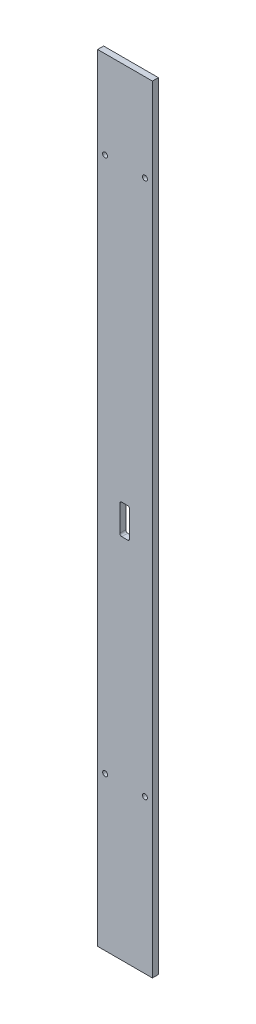
ISO-10303-21;
HEADER;
FILE_DESCRIPTION(('STEP AP214'),'2;1');
FILE_NAME('part.step','',(''),(''),'','','');
FILE_SCHEMA(('AUTOMOTIVE_DESIGN { 1 0 10303 214 1 1 1 1 }'));
ENDSEC;
DATA;
#1=APPLICATION_CONTEXT('core data for automotive mechanical design processes');
#2=APPLICATION_PROTOCOL_DEFINITION('international standard','automotive_design',2000,#1);
#3=PRODUCT_CONTEXT('',#1,'mechanical');
#4=PRODUCT('Part','Part','',(#3));
#5=PRODUCT_RELATED_PRODUCT_CATEGORY('part','',(#4));
#6=PRODUCT_DEFINITION_FORMATION('','',#4);
#7=PRODUCT_DEFINITION_CONTEXT('part definition',#1,'design');
#8=PRODUCT_DEFINITION('design','',#6,#7);
#9=PRODUCT_DEFINITION_SHAPE('','',#8);
#10=(LENGTH_UNIT() NAMED_UNIT(*) SI_UNIT(.MILLI.,.METRE.));
#11=(NAMED_UNIT(*) PLANE_ANGLE_UNIT() SI_UNIT($,.RADIAN.));
#12=(NAMED_UNIT(*) SI_UNIT($,.STERADIAN.) SOLID_ANGLE_UNIT());
#13=UNCERTAINTY_MEASURE_WITH_UNIT(LENGTH_MEASURE(1.E-05),#10,'distance_accuracy_value','');
#14=(GEOMETRIC_REPRESENTATION_CONTEXT(3) GLOBAL_UNCERTAINTY_ASSIGNED_CONTEXT((#13)) GLOBAL_UNIT_ASSIGNED_CONTEXT((#10,
#11,#12)) REPRESENTATION_CONTEXT('',''));
#15=CARTESIAN_POINT('',(0.,0.,0.));
#16=DIRECTION('',(0.,0.,1.));
#17=DIRECTION('',(1.,0.,0.));
#18=AXIS2_PLACEMENT_3D('',#15,#16,#17);
#19=CARTESIAN_POINT('',(-27.5,-390.,3.));
#20=DIRECTION('',(1.,0.,0.));
#21=DIRECTION('',(0.,0.,-1.));
#22=AXIS2_PLACEMENT_3D('',#19,#20,#21);
#23=PLANE('',#22);
#24=DIRECTION('',(0.,-1.,0.));
#25=VECTOR('',#24,1.);
#26=CARTESIAN_POINT('',(-27.5,-390.,-3.));
#27=LINE('',#26,#25);
#28=CARTESIAN_POINT('',(-27.5,390.,-3.));
#29=VERTEX_POINT('',#28);
#30=CARTESIAN_POINT('',(-27.5,-390.,-3.));
#31=VERTEX_POINT('',#30);
#32=EDGE_CURVE('E185',#29,#31,#27,.T.);
#33=ORIENTED_EDGE('',*,*,#32,.T.);
#34=DIRECTION('',(0.,0.,-1.));
#35=VECTOR('',#34,1.);
#36=CARTESIAN_POINT('',(-27.5,-390.,3.));
#37=LINE('',#36,#35);
#38=CARTESIAN_POINT('',(-27.5,-390.,3.));
#39=VERTEX_POINT('',#38);
#40=EDGE_CURVE('E11',#39,#31,#37,.T.);
#41=ORIENTED_EDGE('',*,*,#40,.F.);
#42=DIRECTION('',(0.,-1.,0.));
#43=VECTOR('',#42,1.);
#44=CARTESIAN_POINT('',(-27.5,-390.,3.));
#45=LINE('',#44,#43);
#46=CARTESIAN_POINT('',(-27.5,390.,3.));
#47=VERTEX_POINT('',#46);
#48=EDGE_CURVE('E197',#47,#39,#45,.T.);
#49=ORIENTED_EDGE('',*,*,#48,.F.);
#50=DIRECTION('',(0.,0.,-1.));
#51=VECTOR('',#50,1.);
#52=CARTESIAN_POINT('',(-27.5,390.,3.));
#53=LINE('',#52,#51);
#54=EDGE_CURVE('E207',#47,#29,#53,.T.);
#55=ORIENTED_EDGE('',*,*,#54,.T.);
#56=EDGE_LOOP('',(#33,#41,#49,#55));
#57=FACE_BOUND('',#56,.T.);
#58=ADVANCED_FACE('F36',(#57),#23,.F.);
#59=CARTESIAN_POINT('',(27.5,-390.,3.));
#60=DIRECTION('',(0.,1.,0.));
#61=DIRECTION('',(0.,0.,1.));
#62=AXIS2_PLACEMENT_3D('',#59,#60,#61);
#63=PLANE('',#62);
#64=DIRECTION('',(1.,0.,0.));
#65=VECTOR('',#64,1.);
#66=CARTESIAN_POINT('',(27.5,-390.,-3.));
#67=LINE('',#66,#65);
#68=CARTESIAN_POINT('',(27.5,-390.,-3.));
#69=VERTEX_POINT('',#68);
#70=EDGE_CURVE('E210',#31,#69,#67,.T.);
#71=ORIENTED_EDGE('',*,*,#70,.T.);
#72=DIRECTION('',(0.,0.,-1.));
#73=VECTOR('',#72,1.);
#74=CARTESIAN_POINT('',(27.5,-390.,3.));
#75=LINE('',#74,#73);
#76=CARTESIAN_POINT('',(27.5,-390.,3.));
#77=VERTEX_POINT('',#76);
#78=EDGE_CURVE('E44',#77,#69,#75,.T.);
#79=ORIENTED_EDGE('',*,*,#78,.F.);
#80=DIRECTION('',(1.,0.,0.));
#81=VECTOR('',#80,1.);
#82=CARTESIAN_POINT('',(27.5,-390.,3.));
#83=LINE('',#82,#81);
#84=EDGE_CURVE('E200',#39,#77,#83,.T.);
#85=ORIENTED_EDGE('',*,*,#84,.F.);
#86=ORIENTED_EDGE('',*,*,#40,.T.);
#87=EDGE_LOOP('',(#71,#79,#85,#86));
#88=FACE_BOUND('',#87,.T.);
#89=ADVANCED_FACE('F239',(#88),#63,.F.);
#90=CARTESIAN_POINT('',(27.5,-390.,3.));
#91=DIRECTION('',(-1.,0.,0.));
#92=DIRECTION('',(0.,0.,1.));
#93=AXIS2_PLACEMENT_3D('',#90,#91,#92);
#94=PLANE('',#93);
#95=DIRECTION('',(0.,1.,0.));
#96=VECTOR('',#95,1.);
#97=CARTESIAN_POINT('',(27.5,-390.,-3.));
#98=LINE('',#97,#96);
#99=CARTESIAN_POINT('',(27.5,390.,-3.));
#100=VERTEX_POINT('',#99);
#101=EDGE_CURVE('E212',#69,#100,#98,.T.);
#102=ORIENTED_EDGE('',*,*,#101,.T.);
#103=DIRECTION('',(0.,0.,-1.));
#104=VECTOR('',#103,1.);
#105=CARTESIAN_POINT('',(27.5,390.,3.));
#106=LINE('',#105,#104);
#107=CARTESIAN_POINT('',(27.5,390.,3.));
#108=VERTEX_POINT('',#107);
#109=EDGE_CURVE('E217',#108,#100,#106,.T.);
#110=ORIENTED_EDGE('',*,*,#109,.F.);
#111=DIRECTION('',(0.,1.,0.));
#112=VECTOR('',#111,1.);
#113=CARTESIAN_POINT('',(27.5,-390.,3.));
#114=LINE('',#113,#112);
#115=EDGE_CURVE('E203',#77,#108,#114,.T.);
#116=ORIENTED_EDGE('',*,*,#115,.F.);
#117=ORIENTED_EDGE('',*,*,#78,.T.);
#118=EDGE_LOOP('',(#102,#110,#116,#117));
#119=FACE_BOUND('',#118,.T.);
#120=ADVANCED_FACE('F225',(#119),#94,.F.);
#121=CARTESIAN_POINT('',(27.5,390.,3.));
#122=DIRECTION('',(0.,-1.,0.));
#123=DIRECTION('',(0.,0.,-1.));
#124=AXIS2_PLACEMENT_3D('',#121,#122,#123);
#125=PLANE('',#124);
#126=DIRECTION('',(-1.,0.,0.));
#127=VECTOR('',#126,1.);
#128=CARTESIAN_POINT('',(27.5,390.,-3.));
#129=LINE('',#128,#127);
#130=EDGE_CURVE('E201',#100,#29,#129,.T.);
#131=ORIENTED_EDGE('',*,*,#130,.T.);
#132=ORIENTED_EDGE('',*,*,#54,.F.);
#133=DIRECTION('',(-1.,0.,0.));
#134=VECTOR('',#133,1.);
#135=CARTESIAN_POINT('',(27.5,390.,3.));
#136=LINE('',#135,#134);
#137=EDGE_CURVE('E205',#108,#47,#136,.T.);
#138=ORIENTED_EDGE('',*,*,#137,.F.);
#139=ORIENTED_EDGE('',*,*,#109,.T.);
#140=EDGE_LOOP('',(#131,#132,#138,#139));
#141=FACE_BOUND('',#140,.T.);
#142=ADVANCED_FACE('F234',(#141),#125,.F.);
#143=CARTESIAN_POINT('',(0.,0.,3.));
#144=DIRECTION('',(0.,0.,1.));
#145=DIRECTION('',(1.,0.,0.));
#146=AXIS2_PLACEMENT_3D('',#143,#144,#145);
#147=PLANE('',#146);
#148=CARTESIAN_POINT('',(-20.,302.,3.));
#149=DIRECTION('',(0.,0.,1.));
#150=DIRECTION('',(1.,0.,0.));
#151=AXIS2_PLACEMENT_3D('',#148,#149,#150);
#152=CIRCLE('',#151,2.49999999999999);
#153=CARTESIAN_POINT('',(-17.5,302.,3.));
#154=VERTEX_POINT('',#153);
#155=EDGE_CURVE('E302',#154,#154,#152,.T.);
#156=ORIENTED_EDGE('',*,*,#155,.F.);
#157=EDGE_LOOP('',(#156));
#158=FACE_BOUND('',#157,.T.);
#159=CARTESIAN_POINT('',(20.,302.,3.));
#160=DIRECTION('',(0.,0.,1.));
#161=DIRECTION('',(1.,0.,0.));
#162=AXIS2_PLACEMENT_3D('',#159,#160,#161);
#163=CIRCLE('',#162,2.49999999999999);
#164=CARTESIAN_POINT('',(22.5,302.,3.));
#165=VERTEX_POINT('',#164);
#166=EDGE_CURVE('E312',#165,#165,#163,.T.);
#167=ORIENTED_EDGE('',*,*,#166,.F.);
#168=EDGE_LOOP('',(#167));
#169=FACE_BOUND('',#168,.T.);
#170=CARTESIAN_POINT('',(-20.0000000000001,-236.,3.));
#171=DIRECTION('',(0.,0.,1.));
#172=DIRECTION('',(1.,0.,0.));
#173=AXIS2_PLACEMENT_3D('',#170,#171,#172);
#174=CIRCLE('',#173,2.49999999999999);
#175=CARTESIAN_POINT('',(-17.5000000000001,-236.,3.));
#176=VERTEX_POINT('',#175);
#177=EDGE_CURVE('E317',#176,#176,#174,.T.);
#178=ORIENTED_EDGE('',*,*,#177,.F.);
#179=EDGE_LOOP('',(#178));
#180=FACE_BOUND('',#179,.T.);
#181=CARTESIAN_POINT('',(19.9999999999999,-236.,3.));
#182=DIRECTION('',(0.,0.,1.));
#183=DIRECTION('',(1.,0.,0.));
#184=AXIS2_PLACEMENT_3D('',#181,#182,#183);
#185=CIRCLE('',#184,2.49999999999999);
#186=CARTESIAN_POINT('',(22.4999999999999,-236.,3.));
#187=VERTEX_POINT('',#186);
#188=EDGE_CURVE('E39',#187,#187,#185,.T.);
#189=ORIENTED_EDGE('',*,*,#188,.F.);
#190=EDGE_LOOP('',(#189));
#191=FACE_BOUND('',#190,.T.);
#192=CARTESIAN_POINT('',(-3.25198604520332,6.42058506658847,3.));
#193=DIRECTION('',(0.,0.,-1.));
#194=DIRECTION('',(-1.,0.,0.));
#195=AXIS2_PLACEMENT_3D('',#192,#193,#194);
#196=CIRCLE('',#195,2.);
#197=CARTESIAN_POINT('',(-5.25198604520332,6.42058506658847,3.));
#198=VERTEX_POINT('',#197);
#199=CARTESIAN_POINT('',(-3.25198604520332,8.42058506658847,3.));
#200=VERTEX_POINT('',#199);
#201=EDGE_CURVE('E127',#198,#200,#196,.T.);
#202=ORIENTED_EDGE('',*,*,#201,.T.);
#203=DIRECTION('',(1.,0.,0.));
#204=VECTOR('',#203,1.);
#205=CARTESIAN_POINT('',(-3.25198604520332,8.42058506658847,3.));
#206=LINE('',#205,#204);
#207=CARTESIAN_POINT('',(2.74801395479668,8.42058506658847,3.));
#208=VERTEX_POINT('',#207);
#209=EDGE_CURVE('E136',#200,#208,#206,.T.);
#210=ORIENTED_EDGE('',*,*,#209,.T.);
#211=CARTESIAN_POINT('',(2.74801395479668,6.42058506658847,3.));
#212=DIRECTION('',(0.,0.,-1.));
#213=DIRECTION('',(-1.,0.,0.));
#214=AXIS2_PLACEMENT_3D('',#211,#212,#213);
#215=CIRCLE('',#214,2.);
#216=CARTESIAN_POINT('',(4.74801395479668,6.42058506658847,3.));
#217=VERTEX_POINT('',#216);
#218=EDGE_CURVE('E51',#208,#217,#215,.T.);
#219=ORIENTED_EDGE('',*,*,#218,.T.);
#220=DIRECTION('',(0.,-1.,0.));
#221=VECTOR('',#220,1.);
#222=CARTESIAN_POINT('',(4.74801395479668,-19.5794149334115,3.));
#223=LINE('',#222,#221);
#224=CARTESIAN_POINT('',(4.74801395479668,-19.5794149334115,3.));
#225=VERTEX_POINT('',#224);
#226=EDGE_CURVE('E154',#217,#225,#223,.T.);
#227=ORIENTED_EDGE('',*,*,#226,.T.);
#228=CARTESIAN_POINT('',(2.74801395479668,-19.5794149334115,3.));
#229=DIRECTION('',(0.,0.,-1.));
#230=DIRECTION('',(1.,0.,0.));
#231=AXIS2_PLACEMENT_3D('',#228,#229,#230);
#232=CIRCLE('',#231,2.);
#233=CARTESIAN_POINT('',(2.74801395479668,-21.5794149334115,3.));
#234=VERTEX_POINT('',#233);
#235=EDGE_CURVE('E157',#225,#234,#232,.T.);
#236=ORIENTED_EDGE('',*,*,#235,.T.);
#237=DIRECTION('',(-1.,0.,0.));
#238=VECTOR('',#237,1.);
#239=CARTESIAN_POINT('',(-3.25198604520332,-21.5794149334115,3.));
#240=LINE('',#239,#238);
#241=CARTESIAN_POINT('',(-3.25198604520332,-21.5794149334115,3.));
#242=VERTEX_POINT('',#241);
#243=EDGE_CURVE('E160',#234,#242,#240,.T.);
#244=ORIENTED_EDGE('',*,*,#243,.T.);
#245=CARTESIAN_POINT('',(-3.25198604520332,-19.5794149334115,3.));
#246=DIRECTION('',(0.,0.,-1.));
#247=DIRECTION('',(-1.,0.,0.));
#248=AXIS2_PLACEMENT_3D('',#245,#246,#247);
#249=CIRCLE('',#248,2.);
#250=CARTESIAN_POINT('',(-5.25198604520332,-19.5794149334115,3.));
#251=VERTEX_POINT('',#250);
#252=EDGE_CURVE('E163',#242,#251,#249,.T.);
#253=ORIENTED_EDGE('',*,*,#252,.T.);
#254=DIRECTION('',(0.,1.,0.));
#255=VECTOR('',#254,1.);
#256=CARTESIAN_POINT('',(-5.25198604520332,-19.5794149334115,3.));
#257=LINE('',#256,#255);
#258=EDGE_CURVE('E133',#251,#198,#257,.T.);
#259=ORIENTED_EDGE('',*,*,#258,.T.);
#260=EDGE_LOOP('',(#202,#210,#219,#227,#236,#244,#253,#259));
#261=FACE_BOUND('',#260,.T.);
#262=ORIENTED_EDGE('',*,*,#48,.T.);
#263=ORIENTED_EDGE('',*,*,#84,.T.);
#264=ORIENTED_EDGE('',*,*,#115,.T.);
#265=ORIENTED_EDGE('',*,*,#137,.T.);
#266=EDGE_LOOP('',(#262,#263,#264,#265));
#267=FACE_BOUND('',#266,.T.);
#268=ADVANCED_FACE('F140',(#158,#169,#180,#191,#261,#267),#147,.T.);
#269=CARTESIAN_POINT('',(0.,0.,-3.));
#270=DIRECTION('',(0.,0.,1.));
#271=DIRECTION('',(1.,0.,0.));
#272=AXIS2_PLACEMENT_3D('',#269,#270,#271);
#273=PLANE('',#272);
#274=CARTESIAN_POINT('',(-20.,302.,-3.));
#275=DIRECTION('',(0.,0.,-1.));
#276=DIRECTION('',(-1.,0.,0.));
#277=AXIS2_PLACEMENT_3D('',#274,#275,#276);
#278=CIRCLE('',#277,2.49999999999999);
#279=CARTESIAN_POINT('',(-22.5,302.,-3.));
#280=VERTEX_POINT('',#279);
#281=EDGE_CURVE('E305',#280,#280,#278,.T.);
#282=ORIENTED_EDGE('',*,*,#281,.F.);
#283=EDGE_LOOP('',(#282));
#284=FACE_BOUND('',#283,.T.);
#285=CARTESIAN_POINT('',(20.,302.,-3.));
#286=DIRECTION('',(0.,0.,-1.));
#287=DIRECTION('',(-1.,0.,0.));
#288=AXIS2_PLACEMENT_3D('',#285,#286,#287);
#289=CIRCLE('',#288,2.49999999999999);
#290=CARTESIAN_POINT('',(17.5,302.,-3.));
#291=VERTEX_POINT('',#290);
#292=EDGE_CURVE('E307',#291,#291,#289,.T.);
#293=ORIENTED_EDGE('',*,*,#292,.F.);
#294=EDGE_LOOP('',(#293));
#295=FACE_BOUND('',#294,.T.);
#296=CARTESIAN_POINT('',(-20.0000000000001,-236.,-3.));
#297=DIRECTION('',(0.,0.,-1.));
#298=DIRECTION('',(-1.,0.,0.));
#299=AXIS2_PLACEMENT_3D('',#296,#297,#298);
#300=CIRCLE('',#299,2.49999999999999);
#301=CARTESIAN_POINT('',(-22.5000000000001,-236.,-3.));
#302=VERTEX_POINT('',#301);
#303=EDGE_CURVE('E315',#302,#302,#300,.T.);
#304=ORIENTED_EDGE('',*,*,#303,.F.);
#305=EDGE_LOOP('',(#304));
#306=FACE_BOUND('',#305,.T.);
#307=CARTESIAN_POINT('',(19.9999999999999,-236.,-3.));
#308=DIRECTION('',(0.,0.,-1.));
#309=DIRECTION('',(-1.,0.,0.));
#310=AXIS2_PLACEMENT_3D('',#307,#308,#309);
#311=CIRCLE('',#310,2.49999999999999);
#312=CARTESIAN_POINT('',(17.4999999999999,-236.,-3.));
#313=VERTEX_POINT('',#312);
#314=EDGE_CURVE('E150',#313,#313,#311,.T.);
#315=ORIENTED_EDGE('',*,*,#314,.F.);
#316=EDGE_LOOP('',(#315));
#317=FACE_BOUND('',#316,.T.);
#318=DIRECTION('',(1.,0.,0.));
#319=VECTOR('',#318,1.);
#320=CARTESIAN_POINT('',(-3.25198604520332,8.42058506658847,-3.));
#321=LINE('',#320,#319);
#322=CARTESIAN_POINT('',(-3.25198604520332,8.42058506658847,-3.));
#323=VERTEX_POINT('',#322);
#324=CARTESIAN_POINT('',(2.74801395479668,8.42058506658847,-3.));
#325=VERTEX_POINT('',#324);
#326=EDGE_CURVE('E167',#323,#325,#321,.T.);
#327=ORIENTED_EDGE('',*,*,#326,.F.);
#328=CARTESIAN_POINT('',(-3.25198604520332,6.42058506658847,-3.));
#329=DIRECTION('',(0.,0.,-1.));
#330=DIRECTION('',(-1.,0.,0.));
#331=AXIS2_PLACEMENT_3D('',#328,#329,#330);
#332=CIRCLE('',#331,2.);
#333=CARTESIAN_POINT('',(-5.25198604520332,6.42058506658847,-3.));
#334=VERTEX_POINT('',#333);
#335=EDGE_CURVE('E59',#334,#323,#332,.T.);
#336=ORIENTED_EDGE('',*,*,#335,.F.);
#337=DIRECTION('',(0.,1.,0.));
#338=VECTOR('',#337,1.);
#339=CARTESIAN_POINT('',(-5.25198604520332,-19.5794149334115,-3.));
#340=LINE('',#339,#338);
#341=CARTESIAN_POINT('',(-5.25198604520332,-19.5794149334115,-3.));
#342=VERTEX_POINT('',#341);
#343=EDGE_CURVE('E144',#342,#334,#340,.T.);
#344=ORIENTED_EDGE('',*,*,#343,.F.);
#345=CARTESIAN_POINT('',(-3.25198604520332,-19.5794149334115,-3.));
#346=DIRECTION('',(0.,0.,-1.));
#347=DIRECTION('',(-1.,0.,0.));
#348=AXIS2_PLACEMENT_3D('',#345,#346,#347);
#349=CIRCLE('',#348,2.);
#350=CARTESIAN_POINT('',(-3.25198604520332,-21.5794149334115,-3.));
#351=VERTEX_POINT('',#350);
#352=EDGE_CURVE('E147',#351,#342,#349,.T.);
#353=ORIENTED_EDGE('',*,*,#352,.F.);
#354=DIRECTION('',(-1.,0.,0.));
#355=VECTOR('',#354,1.);
#356=CARTESIAN_POINT('',(-3.25198604520332,-21.5794149334115,-3.));
#357=LINE('',#356,#355);
#358=CARTESIAN_POINT('',(2.74801395479668,-21.5794149334115,-3.));
#359=VERTEX_POINT('',#358);
#360=EDGE_CURVE('E178',#359,#351,#357,.T.);
#361=ORIENTED_EDGE('',*,*,#360,.F.);
#362=CARTESIAN_POINT('',(2.74801395479668,-19.5794149334115,-3.));
#363=DIRECTION('',(0.,0.,-1.));
#364=DIRECTION('',(1.,0.,0.));
#365=AXIS2_PLACEMENT_3D('',#362,#363,#364);
#366=CIRCLE('',#365,2.);
#367=CARTESIAN_POINT('',(4.74801395479668,-19.5794149334115,-3.));
#368=VERTEX_POINT('',#367);
#369=EDGE_CURVE('E175',#368,#359,#366,.T.);
#370=ORIENTED_EDGE('',*,*,#369,.F.);
#371=DIRECTION('',(0.,-1.,0.));
#372=VECTOR('',#371,1.);
#373=CARTESIAN_POINT('',(4.74801395479668,-19.5794149334115,-3.));
#374=LINE('',#373,#372);
#375=CARTESIAN_POINT('',(4.74801395479668,6.42058506658847,-3.));
#376=VERTEX_POINT('',#375);
#377=EDGE_CURVE('E172',#376,#368,#374,.T.);
#378=ORIENTED_EDGE('',*,*,#377,.F.);
#379=CARTESIAN_POINT('',(2.74801395479668,6.42058506658847,-3.));
#380=DIRECTION('',(0.,0.,-1.));
#381=DIRECTION('',(-1.,0.,0.));
#382=AXIS2_PLACEMENT_3D('',#379,#380,#381);
#383=CIRCLE('',#382,2.);
#384=EDGE_CURVE('E169',#325,#376,#383,.T.);
#385=ORIENTED_EDGE('',*,*,#384,.F.);
#386=EDGE_LOOP('',(#327,#336,#344,#353,#361,#370,#378,#385));
#387=FACE_BOUND('',#386,.T.);
#388=ORIENTED_EDGE('',*,*,#32,.F.);
#389=ORIENTED_EDGE('',*,*,#130,.F.);
#390=ORIENTED_EDGE('',*,*,#101,.F.);
#391=ORIENTED_EDGE('',*,*,#70,.F.);
#392=EDGE_LOOP('',(#388,#389,#390,#391));
#393=FACE_BOUND('',#392,.T.);
#394=ADVANCED_FACE('F231',(#284,#295,#306,#317,#387,#393),#273,.F.);
#395=CARTESIAN_POINT('',(-3.25198604520332,6.42058506658847,3.));
#396=DIRECTION('',(0.,0.,-1.));
#397=DIRECTION('',(-1.,0.,0.));
#398=AXIS2_PLACEMENT_3D('',#395,#396,#397);
#399=CYLINDRICAL_SURFACE('',#398,2.);
#400=ORIENTED_EDGE('',*,*,#335,.T.);
#401=DIRECTION('',(0.,0.,-1.));
#402=VECTOR('',#401,1.);
#403=CARTESIAN_POINT('',(-3.25198604520332,8.42058506658847,3.));
#404=LINE('',#403,#402);
#405=EDGE_CURVE('E123',#200,#323,#404,.T.);
#406=ORIENTED_EDGE('',*,*,#405,.F.);
#407=ORIENTED_EDGE('',*,*,#201,.F.);
#408=DIRECTION('',(0.,0.,-1.));
#409=VECTOR('',#408,1.);
#410=CARTESIAN_POINT('',(-5.25198604520332,6.42058506658847,3.));
#411=LINE('',#410,#409);
#412=EDGE_CURVE('E183',#198,#334,#411,.T.);
#413=ORIENTED_EDGE('',*,*,#412,.T.);
#414=EDGE_LOOP('',(#400,#406,#407,#413));
#415=FACE_BOUND('',#414,.T.);
#416=ADVANCED_FACE('F125',(#415),#399,.F.);
#417=CARTESIAN_POINT('',(-5.25198604520332,-19.5794149334115,3.));
#418=DIRECTION('',(-1.,0.,0.));
#419=DIRECTION('',(0.,0.,1.));
#420=AXIS2_PLACEMENT_3D('',#417,#418,#419);
#421=PLANE('',#420);
#422=ORIENTED_EDGE('',*,*,#343,.T.);
#423=ORIENTED_EDGE('',*,*,#412,.F.);
#424=ORIENTED_EDGE('',*,*,#258,.F.);
#425=DIRECTION('',(0.,0.,-1.));
#426=VECTOR('',#425,1.);
#427=CARTESIAN_POINT('',(-5.25198604520332,-19.5794149334115,3.));
#428=LINE('',#427,#426);
#429=EDGE_CURVE('E186',#251,#342,#428,.T.);
#430=ORIENTED_EDGE('',*,*,#429,.T.);
#431=EDGE_LOOP('',(#422,#423,#424,#430));
#432=FACE_BOUND('',#431,.T.);
#433=ADVANCED_FACE('F257',(#432),#421,.F.);
#434=CARTESIAN_POINT('',(-3.25198604520332,-19.5794149334115,3.));
#435=DIRECTION('',(0.,0.,-1.));
#436=DIRECTION('',(-1.,0.,0.));
#437=AXIS2_PLACEMENT_3D('',#434,#435,#436);
#438=CYLINDRICAL_SURFACE('',#437,2.);
#439=ORIENTED_EDGE('',*,*,#352,.T.);
#440=ORIENTED_EDGE('',*,*,#429,.F.);
#441=ORIENTED_EDGE('',*,*,#252,.F.);
#442=DIRECTION('',(0.,0.,-1.));
#443=VECTOR('',#442,1.);
#444=CARTESIAN_POINT('',(-3.25198604520332,-21.5794149334115,3.));
#445=LINE('',#444,#443);
#446=EDGE_CURVE('E188',#242,#351,#445,.T.);
#447=ORIENTED_EDGE('',*,*,#446,.T.);
#448=EDGE_LOOP('',(#439,#440,#441,#447));
#449=FACE_BOUND('',#448,.T.);
#450=ADVANCED_FACE('F275',(#449),#438,.F.);
#451=CARTESIAN_POINT('',(-3.25198604520332,-21.5794149334115,3.));
#452=DIRECTION('',(0.,-1.,0.));
#453=DIRECTION('',(0.,0.,-1.));
#454=AXIS2_PLACEMENT_3D('',#451,#452,#453);
#455=PLANE('',#454);
#456=ORIENTED_EDGE('',*,*,#360,.T.);
#457=ORIENTED_EDGE('',*,*,#446,.F.);
#458=ORIENTED_EDGE('',*,*,#243,.F.);
#459=DIRECTION('',(0.,0.,-1.));
#460=VECTOR('',#459,1.);
#461=CARTESIAN_POINT('',(2.74801395479668,-21.5794149334115,3.));
#462=LINE('',#461,#460);
#463=EDGE_CURVE('E190',#234,#359,#462,.T.);
#464=ORIENTED_EDGE('',*,*,#463,.T.);
#465=EDGE_LOOP('',(#456,#457,#458,#464));
#466=FACE_BOUND('',#465,.T.);
#467=ADVANCED_FACE('F271',(#466),#455,.F.);
#468=CARTESIAN_POINT('',(2.74801395479668,-19.5794149334115,3.));
#469=DIRECTION('',(0.,0.,-1.));
#470=DIRECTION('',(-1.,0.,0.));
#471=AXIS2_PLACEMENT_3D('',#468,#469,#470);
#472=CYLINDRICAL_SURFACE('',#471,2.);
#473=ORIENTED_EDGE('',*,*,#369,.T.);
#474=ORIENTED_EDGE('',*,*,#463,.F.);
#475=ORIENTED_EDGE('',*,*,#235,.F.);
#476=DIRECTION('',(0.,0.,-1.));
#477=VECTOR('',#476,1.);
#478=CARTESIAN_POINT('',(4.74801395479668,-19.5794149334115,3.));
#479=LINE('',#478,#477);
#480=EDGE_CURVE('E192',#225,#368,#479,.T.);
#481=ORIENTED_EDGE('',*,*,#480,.T.);
#482=EDGE_LOOP('',(#473,#474,#475,#481));
#483=FACE_BOUND('',#482,.T.);
#484=ADVANCED_FACE('F267',(#483),#472,.F.);
#485=CARTESIAN_POINT('',(4.74801395479668,-19.5794149334115,3.));
#486=DIRECTION('',(1.,0.,0.));
#487=DIRECTION('',(0.,0.,-1.));
#488=AXIS2_PLACEMENT_3D('',#485,#486,#487);
#489=PLANE('',#488);
#490=ORIENTED_EDGE('',*,*,#377,.T.);
#491=ORIENTED_EDGE('',*,*,#480,.F.);
#492=ORIENTED_EDGE('',*,*,#226,.F.);
#493=DIRECTION('',(0.,0.,-1.));
#494=VECTOR('',#493,1.);
#495=CARTESIAN_POINT('',(4.74801395479668,6.42058506658847,3.));
#496=LINE('',#495,#494);
#497=EDGE_CURVE('E194',#217,#376,#496,.T.);
#498=ORIENTED_EDGE('',*,*,#497,.T.);
#499=EDGE_LOOP('',(#490,#491,#492,#498));
#500=FACE_BOUND('',#499,.T.);
#501=ADVANCED_FACE('F264',(#500),#489,.F.);
#502=CARTESIAN_POINT('',(2.74801395479668,6.42058506658847,3.));
#503=DIRECTION('',(0.,0.,-1.));
#504=DIRECTION('',(-1.,0.,0.));
#505=AXIS2_PLACEMENT_3D('',#502,#503,#504);
#506=CYLINDRICAL_SURFACE('',#505,2.);
#507=ORIENTED_EDGE('',*,*,#384,.T.);
#508=ORIENTED_EDGE('',*,*,#497,.F.);
#509=ORIENTED_EDGE('',*,*,#218,.F.);
#510=DIRECTION('',(0.,0.,-1.));
#511=VECTOR('',#510,1.);
#512=CARTESIAN_POINT('',(2.74801395479668,8.42058506658847,3.));
#513=LINE('',#512,#511);
#514=EDGE_CURVE('E132',#208,#325,#513,.T.);
#515=ORIENTED_EDGE('',*,*,#514,.T.);
#516=EDGE_LOOP('',(#507,#508,#509,#515));
#517=FACE_BOUND('',#516,.T.);
#518=ADVANCED_FACE('F261',(#517),#506,.F.);
#519=CARTESIAN_POINT('',(-3.25198604520332,8.42058506658847,3.));
#520=DIRECTION('',(0.,1.,0.));
#521=DIRECTION('',(0.,0.,1.));
#522=AXIS2_PLACEMENT_3D('',#519,#520,#521);
#523=PLANE('',#522);
#524=ORIENTED_EDGE('',*,*,#326,.T.);
#525=ORIENTED_EDGE('',*,*,#514,.F.);
#526=ORIENTED_EDGE('',*,*,#209,.F.);
#527=ORIENTED_EDGE('',*,*,#405,.T.);
#528=EDGE_LOOP('',(#524,#525,#526,#527));
#529=FACE_BOUND('',#528,.T.);
#530=ADVANCED_FACE('F137',(#529),#523,.F.);
#531=CARTESIAN_POINT('',(19.9999999999999,-236.,-3.));
#532=DIRECTION('',(0.,0.,-1.));
#533=DIRECTION('',(-1.,0.,0.));
#534=AXIS2_PLACEMENT_3D('',#531,#532,#533);
#535=CYLINDRICAL_SURFACE('',#534,2.49999999999999);
#536=ORIENTED_EDGE('',*,*,#188,.T.);
#537=EDGE_LOOP('',(#536));
#538=FACE_BOUND('',#537,.T.);
#539=ORIENTED_EDGE('',*,*,#314,.T.);
#540=EDGE_LOOP('',(#539));
#541=FACE_BOUND('',#540,.T.);
#542=ADVANCED_FACE('F260',(#538,#541),#535,.F.);
#543=CARTESIAN_POINT('',(-20.0000000000001,-236.,-3.));
#544=DIRECTION('',(0.,0.,-1.));
#545=DIRECTION('',(-1.,0.,0.));
#546=AXIS2_PLACEMENT_3D('',#543,#544,#545);
#547=CYLINDRICAL_SURFACE('',#546,2.49999999999999);
#548=ORIENTED_EDGE('',*,*,#177,.T.);
#549=EDGE_LOOP('',(#548));
#550=FACE_BOUND('',#549,.T.);
#551=ORIENTED_EDGE('',*,*,#303,.T.);
#552=EDGE_LOOP('',(#551));
#553=FACE_BOUND('',#552,.T.);
#554=ADVANCED_FACE('F285',(#550,#553),#547,.F.);
#555=CARTESIAN_POINT('',(20.,302.,-3.));
#556=DIRECTION('',(0.,0.,-1.));
#557=DIRECTION('',(-1.,0.,0.));
#558=AXIS2_PLACEMENT_3D('',#555,#556,#557);
#559=CYLINDRICAL_SURFACE('',#558,2.49999999999999);
#560=ORIENTED_EDGE('',*,*,#166,.T.);
#561=EDGE_LOOP('',(#560));
#562=FACE_BOUND('',#561,.T.);
#563=ORIENTED_EDGE('',*,*,#292,.T.);
#564=EDGE_LOOP('',(#563));
#565=FACE_BOUND('',#564,.T.);
#566=ADVANCED_FACE('F289',(#562,#565),#559,.F.);
#567=CARTESIAN_POINT('',(-20.,302.,-3.));
#568=DIRECTION('',(0.,0.,-1.));
#569=DIRECTION('',(-1.,0.,0.));
#570=AXIS2_PLACEMENT_3D('',#567,#568,#569);
#571=CYLINDRICAL_SURFACE('',#570,2.49999999999999);
#572=ORIENTED_EDGE('',*,*,#155,.T.);
#573=EDGE_LOOP('',(#572));
#574=FACE_BOUND('',#573,.T.);
#575=ORIENTED_EDGE('',*,*,#281,.T.);
#576=EDGE_LOOP('',(#575));
#577=FACE_BOUND('',#576,.T.);
#578=ADVANCED_FACE('F293',(#574,#577),#571,.F.);
#579=CLOSED_SHELL('',(#58,#89,#120,#142,#268,#394,#416,#433,#450,#467,#484,#501,#518,#530,#542,
#554,#566,#578));
#580=MANIFOLD_SOLID_BREP('B2',#579);
#581=ADVANCED_BREP_SHAPE_REPRESENTATION('',(#18,#580),#14);
#582=SHAPE_DEFINITION_REPRESENTATION(#9,#581);
ENDSEC;
END-ISO-10303-21;
